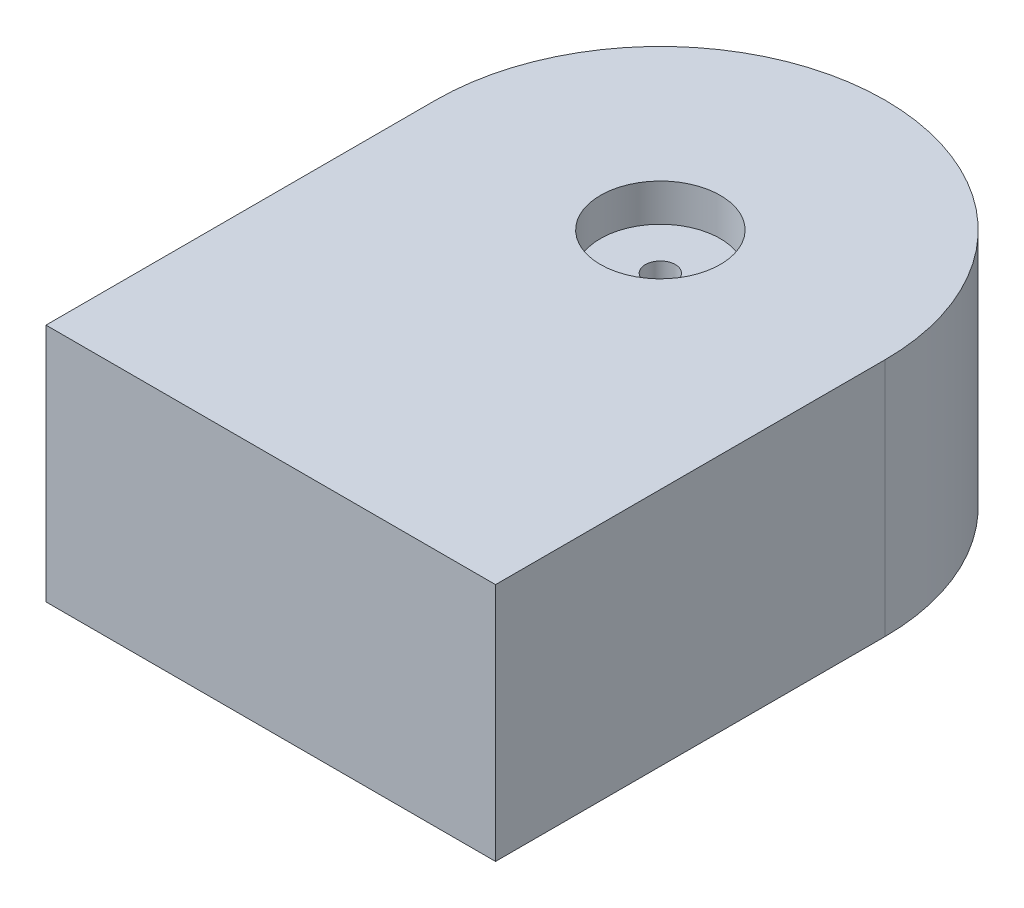
ISO-10303-21;
HEADER;
FILE_DESCRIPTION(('STEP AP214'),'2;1');
FILE_NAME('part.step','',(''),(''),'','','');
FILE_SCHEMA(('AUTOMOTIVE_DESIGN { 1 0 10303 214 1 1 1 1 }'));
ENDSEC;
DATA;
#1=APPLICATION_CONTEXT('core data for automotive mechanical design processes');
#2=APPLICATION_PROTOCOL_DEFINITION('international standard','automotive_design',2000,#1);
#3=PRODUCT_CONTEXT('',#1,'mechanical');
#4=PRODUCT('Part','Part','',(#3));
#5=PRODUCT_RELATED_PRODUCT_CATEGORY('part','',(#4));
#6=PRODUCT_DEFINITION_FORMATION('','',#4);
#7=PRODUCT_DEFINITION_CONTEXT('part definition',#1,'design');
#8=PRODUCT_DEFINITION('design','',#6,#7);
#9=PRODUCT_DEFINITION_SHAPE('','',#8);
#10=(LENGTH_UNIT() NAMED_UNIT(*) SI_UNIT(.MILLI.,.METRE.));
#11=(NAMED_UNIT(*) PLANE_ANGLE_UNIT() SI_UNIT($,.RADIAN.));
#12=(NAMED_UNIT(*) SI_UNIT($,.STERADIAN.) SOLID_ANGLE_UNIT());
#13=UNCERTAINTY_MEASURE_WITH_UNIT(LENGTH_MEASURE(1.E-05),#10,'distance_accuracy_value','');
#14=(GEOMETRIC_REPRESENTATION_CONTEXT(3) GLOBAL_UNCERTAINTY_ASSIGNED_CONTEXT((#13)) GLOBAL_UNIT_ASSIGNED_CONTEXT((#10,
#11,#12)) REPRESENTATION_CONTEXT('',''));
#15=CARTESIAN_POINT('',(0.,0.,0.));
#16=DIRECTION('',(0.,0.,1.));
#17=DIRECTION('',(1.,0.,0.));
#18=AXIS2_PLACEMENT_3D('',#15,#16,#17);
#19=CARTESIAN_POINT('',(0.,16.,0.));
#20=DIRECTION('',(1.,0.,0.));
#21=DIRECTION('',(0.,0.,-1.));
#22=AXIS2_PLACEMENT_3D('',#19,#20,#21);
#23=PLANE('',#22);
#24=DIRECTION('',(0.,0.,1.));
#25=VECTOR('',#24,1.);
#26=CARTESIAN_POINT('',(0.,16.,0.));
#27=LINE('',#26,#25);
#28=CARTESIAN_POINT('',(0.,16.,-26.));
#29=VERTEX_POINT('',#28);
#30=CARTESIAN_POINT('',(0.,16.,0.));
#31=VERTEX_POINT('',#30);
#32=EDGE_CURVE('E72',#29,#31,#27,.T.);
#33=ORIENTED_EDGE('',*,*,#32,.F.);
#34=DIRECTION('',(0.,-1.,0.));
#35=VECTOR('',#34,1.);
#36=CARTESIAN_POINT('',(0.,16.,-26.));
#37=LINE('',#36,#35);
#38=CARTESIAN_POINT('',(0.,0.,-26.));
#39=VERTEX_POINT('',#38);
#40=EDGE_CURVE('E11',#29,#39,#37,.T.);
#41=ORIENTED_EDGE('',*,*,#40,.T.);
#42=DIRECTION('',(0.,0.,1.));
#43=VECTOR('',#42,1.);
#44=CARTESIAN_POINT('',(0.,0.,0.));
#45=LINE('',#44,#43);
#46=CARTESIAN_POINT('',(0.,0.,0.));
#47=VERTEX_POINT('',#46);
#48=EDGE_CURVE('E92',#39,#47,#45,.T.);
#49=ORIENTED_EDGE('',*,*,#48,.T.);
#50=DIRECTION('',(0.,-1.,0.));
#51=VECTOR('',#50,1.);
#52=CARTESIAN_POINT('',(0.,16.,0.));
#53=LINE('',#52,#51);
#54=EDGE_CURVE('E85',#31,#47,#53,.T.);
#55=ORIENTED_EDGE('',*,*,#54,.F.);
#56=EDGE_LOOP('',(#33,#41,#49,#55));
#57=FACE_BOUND('',#56,.T.);
#58=ADVANCED_FACE('F31',(#57),#23,.F.);
#59=CARTESIAN_POINT('',(0.,16.,0.));
#60=DIRECTION('',(0.,0.,-1.));
#61=DIRECTION('',(-1.,0.,0.));
#62=AXIS2_PLACEMENT_3D('',#59,#60,#61);
#63=PLANE('',#62);
#64=DIRECTION('',(1.,0.,0.));
#65=VECTOR('',#64,1.);
#66=CARTESIAN_POINT('',(0.,0.,0.));
#67=LINE('',#66,#65);
#68=CARTESIAN_POINT('',(30.,0.,0.));
#69=VERTEX_POINT('',#68);
#70=EDGE_CURVE('E116',#47,#69,#67,.T.);
#71=ORIENTED_EDGE('',*,*,#70,.T.);
#72=DIRECTION('',(0.,-1.,0.));
#73=VECTOR('',#72,1.);
#74=CARTESIAN_POINT('',(30.,16.,0.));
#75=LINE('',#74,#73);
#76=CARTESIAN_POINT('',(30.,16.,0.));
#77=VERTEX_POINT('',#76);
#78=EDGE_CURVE('E87',#77,#69,#75,.T.);
#79=ORIENTED_EDGE('',*,*,#78,.F.);
#80=DIRECTION('',(1.,0.,0.));
#81=VECTOR('',#80,1.);
#82=CARTESIAN_POINT('',(0.,16.,0.));
#83=LINE('',#82,#81);
#84=EDGE_CURVE('E75',#31,#77,#83,.T.);
#85=ORIENTED_EDGE('',*,*,#84,.F.);
#86=ORIENTED_EDGE('',*,*,#54,.T.);
#87=EDGE_LOOP('',(#71,#79,#85,#86));
#88=FACE_BOUND('',#87,.T.);
#89=ADVANCED_FACE('F84',(#88),#63,.F.);
#90=CARTESIAN_POINT('',(30.,16.,0.));
#91=DIRECTION('',(-1.,0.,0.));
#92=DIRECTION('',(0.,0.,1.));
#93=AXIS2_PLACEMENT_3D('',#90,#91,#92);
#94=PLANE('',#93);
#95=DIRECTION('',(0.,0.,-1.));
#96=VECTOR('',#95,1.);
#97=CARTESIAN_POINT('',(30.,0.,0.));
#98=LINE('',#97,#96);
#99=CARTESIAN_POINT('',(30.,0.,-26.));
#100=VERTEX_POINT('',#99);
#101=EDGE_CURVE('E80',#69,#100,#98,.T.);
#102=ORIENTED_EDGE('',*,*,#101,.T.);
#103=DIRECTION('',(0.,-1.,0.));
#104=VECTOR('',#103,1.);
#105=CARTESIAN_POINT('',(30.,16.,-26.));
#106=LINE('',#105,#104);
#107=CARTESIAN_POINT('',(30.,16.,-26.));
#108=VERTEX_POINT('',#107);
#109=EDGE_CURVE('E102',#100,#108,#106,.F.);
#110=ORIENTED_EDGE('',*,*,#109,.T.);
#111=DIRECTION('',(0.,0.,-1.));
#112=VECTOR('',#111,1.);
#113=CARTESIAN_POINT('',(30.,16.,0.));
#114=LINE('',#113,#112);
#115=EDGE_CURVE('E89',#77,#108,#114,.T.);
#116=ORIENTED_EDGE('',*,*,#115,.F.);
#117=ORIENTED_EDGE('',*,*,#78,.T.);
#118=EDGE_LOOP('',(#102,#110,#116,#117));
#119=FACE_BOUND('',#118,.T.);
#120=ADVANCED_FACE('F109',(#119),#94,.F.);
#121=CARTESIAN_POINT('',(0.,16.,-41.));
#122=DIRECTION('',(0.,-1.,0.));
#123=DIRECTION('',(0.,0.,-1.));
#124=AXIS2_PLACEMENT_3D('',#121,#122,#123);
#125=PLANE('',#124);
#126=CARTESIAN_POINT('',(15.,16.,-26.));
#127=DIRECTION('',(0.,1.,0.));
#128=DIRECTION('',(0.,0.,1.));
#129=AXIS2_PLACEMENT_3D('',#126,#127,#128);
#130=CIRCLE('',#129,4.);
#131=CARTESIAN_POINT('',(15.,16.,-22.));
#132=VERTEX_POINT('',#131);
#133=EDGE_CURVE('E126',#132,#132,#130,.T.);
#134=ORIENTED_EDGE('',*,*,#133,.F.);
#135=EDGE_LOOP('',(#134));
#136=FACE_BOUND('',#135,.T.);
#137=ORIENTED_EDGE('',*,*,#115,.T.);
#138=CARTESIAN_POINT('',(15.,16.,-26.));
#139=DIRECTION('',(0.,-1.,0.));
#140=DIRECTION('',(0.,0.,-1.));
#141=AXIS2_PLACEMENT_3D('',#138,#139,#140);
#142=CIRCLE('',#141,15.);
#143=CARTESIAN_POINT('',(15.,16.,-41.));
#144=VERTEX_POINT('',#143);
#145=EDGE_CURVE('E40',#108,#144,#142,.F.);
#146=ORIENTED_EDGE('',*,*,#145,.T.);
#147=CARTESIAN_POINT('',(15.,16.,-26.));
#148=DIRECTION('',(0.,-1.,0.));
#149=DIRECTION('',(0.,0.,-1.));
#150=AXIS2_PLACEMENT_3D('',#147,#148,#149);
#151=CIRCLE('',#150,15.);
#152=EDGE_CURVE('E50',#144,#29,#151,.F.);
#153=ORIENTED_EDGE('',*,*,#152,.T.);
#154=ORIENTED_EDGE('',*,*,#32,.T.);
#155=ORIENTED_EDGE('',*,*,#84,.T.);
#156=EDGE_LOOP('',(#137,#146,#153,#154,#155));
#157=FACE_BOUND('',#156,.T.);
#158=ADVANCED_FACE('F74',(#136,#157),#125,.F.);
#159=CARTESIAN_POINT('',(0.,0.,-41.));
#160=DIRECTION('',(0.,-1.,0.));
#161=DIRECTION('',(0.,0.,-1.));
#162=AXIS2_PLACEMENT_3D('',#159,#160,#161);
#163=PLANE('',#162);
#164=CARTESIAN_POINT('',(15.,0.,-26.));
#165=DIRECTION('',(0.,1.,0.));
#166=DIRECTION('',(0.,0.,1.));
#167=AXIS2_PLACEMENT_3D('',#164,#165,#166);
#168=CIRCLE('',#167,1.);
#169=CARTESIAN_POINT('',(15.,0.,-25.));
#170=VERTEX_POINT('',#169);
#171=EDGE_CURVE('E131',#170,#170,#168,.T.);
#172=ORIENTED_EDGE('',*,*,#171,.T.);
#173=EDGE_LOOP('',(#172));
#174=FACE_BOUND('',#173,.T.);
#175=CARTESIAN_POINT('',(15.,0.,-26.));
#176=DIRECTION('',(0.,-1.,0.));
#177=DIRECTION('',(0.,0.,-1.));
#178=AXIS2_PLACEMENT_3D('',#175,#176,#177);
#179=CIRCLE('',#178,15.);
#180=CARTESIAN_POINT('',(15.,0.,-41.));
#181=VERTEX_POINT('',#180);
#182=EDGE_CURVE('E94',#39,#181,#179,.T.);
#183=ORIENTED_EDGE('',*,*,#182,.T.);
#184=CARTESIAN_POINT('',(15.,0.,-26.));
#185=DIRECTION('',(0.,-1.,0.));
#186=DIRECTION('',(0.,0.,-1.));
#187=AXIS2_PLACEMENT_3D('',#184,#185,#186);
#188=CIRCLE('',#187,15.);
#189=EDGE_CURVE('E96',#181,#100,#188,.T.);
#190=ORIENTED_EDGE('',*,*,#189,.T.);
#191=ORIENTED_EDGE('',*,*,#101,.F.);
#192=ORIENTED_EDGE('',*,*,#70,.F.);
#193=ORIENTED_EDGE('',*,*,#48,.F.);
#194=EDGE_LOOP('',(#183,#190,#191,#192,#193));
#195=FACE_BOUND('',#194,.T.);
#196=ADVANCED_FACE('F118',(#174,#195),#163,.T.);
#197=CARTESIAN_POINT('',(15.,16.,-26.));
#198=DIRECTION('',(0.,-1.,0.));
#199=DIRECTION('',(0.,0.,-1.));
#200=AXIS2_PLACEMENT_3D('',#197,#198,#199);
#201=CYLINDRICAL_SURFACE('',#200,15.);
#202=ORIENTED_EDGE('',*,*,#40,.F.);
#203=ORIENTED_EDGE('',*,*,#152,.F.);
#204=DIRECTION('',(0.,-1.,0.));
#205=VECTOR('',#204,1.);
#206=CARTESIAN_POINT('',(15.,16.,-41.));
#207=LINE('',#206,#205);
#208=EDGE_CURVE('E35',#181,#144,#207,.F.);
#209=ORIENTED_EDGE('',*,*,#208,.F.);
#210=ORIENTED_EDGE('',*,*,#182,.F.);
#211=EDGE_LOOP('',(#202,#203,#209,#210));
#212=FACE_BOUND('',#211,.T.);
#213=ADVANCED_FACE('F33',(#212),#201,.T.);
#214=CARTESIAN_POINT('',(15.,16.,-26.));
#215=DIRECTION('',(0.,-1.,0.));
#216=DIRECTION('',(0.,0.,-1.));
#217=AXIS2_PLACEMENT_3D('',#214,#215,#216);
#218=CYLINDRICAL_SURFACE('',#217,15.);
#219=ORIENTED_EDGE('',*,*,#145,.F.);
#220=ORIENTED_EDGE('',*,*,#109,.F.);
#221=ORIENTED_EDGE('',*,*,#189,.F.);
#222=ORIENTED_EDGE('',*,*,#208,.T.);
#223=EDGE_LOOP('',(#219,#220,#221,#222));
#224=FACE_BOUND('',#223,.T.);
#225=ADVANCED_FACE('F122',(#224),#218,.T.);
#226=CARTESIAN_POINT('',(15.,13.5,-26.));
#227=DIRECTION('',(0.,1.,0.));
#228=DIRECTION('',(0.,0.,1.));
#229=AXIS2_PLACEMENT_3D('',#226,#227,#228);
#230=CYLINDRICAL_SURFACE('',#229,4.);
#231=CARTESIAN_POINT('',(15.,13.5,-26.));
#232=DIRECTION('',(0.,1.,0.));
#233=DIRECTION('',(0.,0.,1.));
#234=AXIS2_PLACEMENT_3D('',#231,#232,#233);
#235=CIRCLE('',#234,4.);
#236=CARTESIAN_POINT('',(15.,13.5,-22.));
#237=VERTEX_POINT('',#236);
#238=EDGE_CURVE('E124',#237,#237,#235,.T.);
#239=ORIENTED_EDGE('',*,*,#238,.F.);
#240=EDGE_LOOP('',(#239));
#241=FACE_BOUND('',#240,.T.);
#242=ORIENTED_EDGE('',*,*,#133,.T.);
#243=EDGE_LOOP('',(#242));
#244=FACE_BOUND('',#243,.T.);
#245=ADVANCED_FACE('F149',(#241,#244),#230,.F.);
#246=CARTESIAN_POINT('',(15.,13.5,-26.));
#247=DIRECTION('',(0.,1.,0.));
#248=DIRECTION('',(0.,0.,1.));
#249=AXIS2_PLACEMENT_3D('',#246,#247,#248);
#250=PLANE('',#249);
#251=CARTESIAN_POINT('',(15.,13.5,-26.));
#252=DIRECTION('',(0.,1.,0.));
#253=DIRECTION('',(0.,0.,1.));
#254=AXIS2_PLACEMENT_3D('',#251,#252,#253);
#255=CIRCLE('',#254,1.);
#256=CARTESIAN_POINT('',(15.,13.5,-25.));
#257=VERTEX_POINT('',#256);
#258=EDGE_CURVE('E134',#257,#257,#255,.T.);
#259=ORIENTED_EDGE('',*,*,#258,.F.);
#260=EDGE_LOOP('',(#259));
#261=FACE_BOUND('',#260,.T.);
#262=ORIENTED_EDGE('',*,*,#238,.T.);
#263=EDGE_LOOP('',(#262));
#264=FACE_BOUND('',#263,.T.);
#265=ADVANCED_FACE('F144',(#261,#264),#250,.T.);
#266=CARTESIAN_POINT('',(15.,0.,-26.));
#267=DIRECTION('',(0.,1.,0.));
#268=DIRECTION('',(0.,0.,1.));
#269=AXIS2_PLACEMENT_3D('',#266,#267,#268);
#270=CYLINDRICAL_SURFACE('',#269,1.);
#271=ORIENTED_EDGE('',*,*,#171,.F.);
#272=EDGE_LOOP('',(#271));
#273=FACE_BOUND('',#272,.T.);
#274=ORIENTED_EDGE('',*,*,#258,.T.);
#275=EDGE_LOOP('',(#274));
#276=FACE_BOUND('',#275,.T.);
#277=ADVANCED_FACE('F141',(#273,#276),#270,.F.);
#278=CLOSED_SHELL('',(#58,#89,#120,#158,#196,#213,#225,#245,#265,#277));
#279=MANIFOLD_SOLID_BREP('B2',#278);
#280=ADVANCED_BREP_SHAPE_REPRESENTATION('',(#18,#279),#14);
#281=SHAPE_DEFINITION_REPRESENTATION(#9,#280);
ENDSEC;
END-ISO-10303-21;
